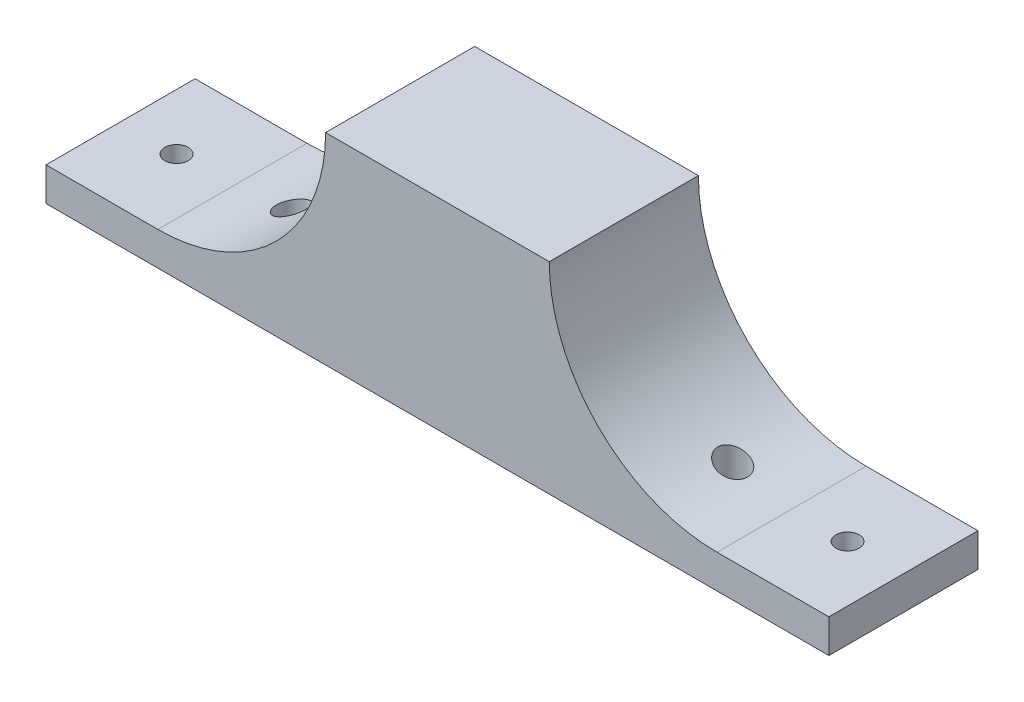
ISO-10303-21;
HEADER;
FILE_DESCRIPTION(('STEP AP214'),'2;1');
FILE_NAME('part.step','',(''),(''),'','','');
FILE_SCHEMA(('AUTOMOTIVE_DESIGN { 1 0 10303 214 1 1 1 1 }'));
ENDSEC;
DATA;
#1=APPLICATION_CONTEXT('core data for automotive mechanical design processes');
#2=APPLICATION_PROTOCOL_DEFINITION('international standard','automotive_design',2000,#1);
#3=PRODUCT_CONTEXT('',#1,'mechanical');
#4=PRODUCT('Part','Part','',(#3));
#5=PRODUCT_RELATED_PRODUCT_CATEGORY('part','',(#4));
#6=PRODUCT_DEFINITION_FORMATION('','',#4);
#7=PRODUCT_DEFINITION_CONTEXT('part definition',#1,'design');
#8=PRODUCT_DEFINITION('design','',#6,#7);
#9=PRODUCT_DEFINITION_SHAPE('','',#8);
#10=(LENGTH_UNIT() NAMED_UNIT(*) SI_UNIT(.MILLI.,.METRE.));
#11=(NAMED_UNIT(*) PLANE_ANGLE_UNIT() SI_UNIT($,.RADIAN.));
#12=(NAMED_UNIT(*) SI_UNIT($,.STERADIAN.) SOLID_ANGLE_UNIT());
#13=UNCERTAINTY_MEASURE_WITH_UNIT(LENGTH_MEASURE(1.E-05),#10,'distance_accuracy_value','');
#14=(GEOMETRIC_REPRESENTATION_CONTEXT(3) GLOBAL_UNCERTAINTY_ASSIGNED_CONTEXT((#13)) GLOBAL_UNIT_ASSIGNED_CONTEXT((#10,
#11,#12)) REPRESENTATION_CONTEXT('',''));
#15=CARTESIAN_POINT('',(0.,0.,0.));
#16=DIRECTION('',(0.,0.,1.));
#17=DIRECTION('',(1.,0.,0.));
#18=AXIS2_PLACEMENT_3D('',#15,#16,#17);
#19=CARTESIAN_POINT('',(-60.,54.,40.));
#20=DIRECTION('',(0.,0.,-1.));
#21=DIRECTION('',(-1.,0.,0.));
#22=AXIS2_PLACEMENT_3D('',#19,#20,#21);
#23=PLANE('',#22);
#24=CARTESIAN_POINT('',(-105.,54.,40.));
#25=DIRECTION('',(0.,0.,-1.));
#26=DIRECTION('',(-1.,0.,0.));
#27=AXIS2_PLACEMENT_3D('',#24,#25,#26);
#28=CIRCLE('',#27,45.0000000000001);
#29=CARTESIAN_POINT('',(-59.9999999999999,54.,40.));
#30=VERTEX_POINT('',#29);
#31=CARTESIAN_POINT('',(-105.,9.,40.));
#32=VERTEX_POINT('',#31);
#33=EDGE_CURVE('E120',#30,#32,#28,.T.);
#34=ORIENTED_EDGE('',*,*,#33,.T.);
#35=DIRECTION('',(-1.,0.,0.));
#36=VECTOR('',#35,1.);
#37=CARTESIAN_POINT('',(-60.,9.,40.));
#38=LINE('',#37,#36);
#39=CARTESIAN_POINT('',(-135.,9.,40.));
#40=VERTEX_POINT('',#39);
#41=EDGE_CURVE('E110',#32,#40,#38,.T.);
#42=ORIENTED_EDGE('',*,*,#41,.T.);
#43=DIRECTION('',(0.,-1.,0.));
#44=VECTOR('',#43,1.);
#45=CARTESIAN_POINT('',(-135.,54.,40.));
#46=LINE('',#45,#44);
#47=CARTESIAN_POINT('',(-135.,0.,40.));
#48=VERTEX_POINT('',#47);
#49=EDGE_CURVE('E117',#40,#48,#46,.T.);
#50=ORIENTED_EDGE('',*,*,#49,.T.);
#51=DIRECTION('',(1.,0.,0.));
#52=VECTOR('',#51,1.);
#53=CARTESIAN_POINT('',(-60.,0.,40.));
#54=LINE('',#53,#52);
#55=CARTESIAN_POINT('',(75.,0.,40.));
#56=VERTEX_POINT('',#55);
#57=EDGE_CURVE('E182',#48,#56,#54,.T.);
#58=ORIENTED_EDGE('',*,*,#57,.T.);
#59=DIRECTION('',(0.,-1.,0.));
#60=VECTOR('',#59,1.);
#61=CARTESIAN_POINT('',(75.,54.,40.));
#62=LINE('',#61,#60);
#63=CARTESIAN_POINT('',(75.,8.99999999999994,40.));
#64=VERTEX_POINT('',#63);
#65=EDGE_CURVE('E179',#64,#56,#62,.T.);
#66=ORIENTED_EDGE('',*,*,#65,.F.);
#67=DIRECTION('',(1.,0.,0.));
#68=VECTOR('',#67,1.);
#69=CARTESIAN_POINT('',(0.,9.,40.));
#70=LINE('',#69,#68);
#71=CARTESIAN_POINT('',(45.,9.,40.));
#72=VERTEX_POINT('',#71);
#73=EDGE_CURVE('E67',#72,#64,#70,.T.);
#74=ORIENTED_EDGE('',*,*,#73,.F.);
#75=CARTESIAN_POINT('',(45.,54.,40.));
#76=DIRECTION('',(0.,0.,1.));
#77=DIRECTION('',(1.,0.,0.));
#78=AXIS2_PLACEMENT_3D('',#75,#76,#77);
#79=CIRCLE('',#78,45.0000000000001);
#80=CARTESIAN_POINT('',(0.,54.,40.));
#81=VERTEX_POINT('',#80);
#82=EDGE_CURVE('E146',#81,#72,#79,.T.);
#83=ORIENTED_EDGE('',*,*,#82,.F.);
#84=DIRECTION('',(1.,0.,0.));
#85=VECTOR('',#84,1.);
#86=CARTESIAN_POINT('',(-60.,54.,40.));
#87=LINE('',#86,#85);
#88=EDGE_CURVE('E183',#30,#81,#87,.T.);
#89=ORIENTED_EDGE('',*,*,#88,.F.);
#90=EDGE_LOOP('',(#34,#42,#50,#58,#66,#74,#83,#89));
#91=FACE_BOUND('',#90,.T.);
#92=ADVANCED_FACE('F45',(#91),#23,.F.);
#93=CARTESIAN_POINT('',(-60.,54.,0.));
#94=DIRECTION('',(0.,0.,1.));
#95=DIRECTION('',(1.,0.,0.));
#96=AXIS2_PLACEMENT_3D('',#93,#94,#95);
#97=PLANE('',#96);
#98=CARTESIAN_POINT('',(-105.,54.,0.));
#99=DIRECTION('',(0.,0.,1.));
#100=DIRECTION('',(1.,0.,0.));
#101=AXIS2_PLACEMENT_3D('',#98,#99,#100);
#102=CIRCLE('',#101,45.0000000000001);
#103=CARTESIAN_POINT('',(-59.9999999999999,54.,0.));
#104=VERTEX_POINT('',#103);
#105=CARTESIAN_POINT('',(-105.,9.,0.));
#106=VERTEX_POINT('',#105);
#107=EDGE_CURVE('E236',#104,#106,#102,.F.);
#108=ORIENTED_EDGE('',*,*,#107,.F.);
#109=DIRECTION('',(-1.,0.,0.));
#110=VECTOR('',#109,1.);
#111=CARTESIAN_POINT('',(-60.,54.,0.));
#112=LINE('',#111,#110);
#113=CARTESIAN_POINT('',(0.,54.,0.));
#114=VERTEX_POINT('',#113);
#115=EDGE_CURVE('E186',#114,#104,#112,.T.);
#116=ORIENTED_EDGE('',*,*,#115,.F.);
#117=CARTESIAN_POINT('',(45.,54.,0.));
#118=DIRECTION('',(0.,0.,1.));
#119=DIRECTION('',(1.,0.,0.));
#120=AXIS2_PLACEMENT_3D('',#117,#118,#119);
#121=CIRCLE('',#120,45.0000000000001);
#122=CARTESIAN_POINT('',(45.,9.,0.));
#123=VERTEX_POINT('',#122);
#124=EDGE_CURVE('E160',#114,#123,#121,.T.);
#125=ORIENTED_EDGE('',*,*,#124,.T.);
#126=DIRECTION('',(1.,0.,0.));
#127=VECTOR('',#126,1.);
#128=CARTESIAN_POINT('',(-60.,9.,0.));
#129=LINE('',#128,#127);
#130=CARTESIAN_POINT('',(75.,9.,0.));
#131=VERTEX_POINT('',#130);
#132=EDGE_CURVE('E164',#123,#131,#129,.T.);
#133=ORIENTED_EDGE('',*,*,#132,.T.);
#134=DIRECTION('',(0.,-1.,0.));
#135=VECTOR('',#134,1.);
#136=CARTESIAN_POINT('',(75.,54.,0.));
#137=LINE('',#136,#135);
#138=CARTESIAN_POINT('',(75.,0.,0.));
#139=VERTEX_POINT('',#138);
#140=EDGE_CURVE('E176',#131,#139,#137,.T.);
#141=ORIENTED_EDGE('',*,*,#140,.T.);
#142=DIRECTION('',(-1.,0.,0.));
#143=VECTOR('',#142,1.);
#144=CARTESIAN_POINT('',(-60.,0.,0.));
#145=LINE('',#144,#143);
#146=CARTESIAN_POINT('',(-135.,0.,0.));
#147=VERTEX_POINT('',#146);
#148=EDGE_CURVE('E187',#139,#147,#145,.T.);
#149=ORIENTED_EDGE('',*,*,#148,.T.);
#150=DIRECTION('',(0.,-1.,0.));
#151=VECTOR('',#150,1.);
#152=CARTESIAN_POINT('',(-135.,54.,0.));
#153=LINE('',#152,#151);
#154=CARTESIAN_POINT('',(-135.,9.,0.));
#155=VERTEX_POINT('',#154);
#156=EDGE_CURVE('E129',#155,#147,#153,.T.);
#157=ORIENTED_EDGE('',*,*,#156,.F.);
#158=DIRECTION('',(-1.,0.,0.));
#159=VECTOR('',#158,1.);
#160=CARTESIAN_POINT('',(-60.,9.,0.));
#161=LINE('',#160,#159);
#162=EDGE_CURVE('E60',#106,#155,#161,.T.);
#163=ORIENTED_EDGE('',*,*,#162,.F.);
#164=EDGE_LOOP('',(#108,#116,#125,#133,#141,#149,#157,#163));
#165=FACE_BOUND('',#164,.T.);
#166=ADVANCED_FACE('F251',(#165),#97,.F.);
#167=CARTESIAN_POINT('',(0.,54.,0.));
#168=DIRECTION('',(0.,1.,0.));
#169=DIRECTION('',(0.,0.,1.));
#170=AXIS2_PLACEMENT_3D('',#167,#168,#169);
#171=PLANE('',#170);
#172=ORIENTED_EDGE('',*,*,#115,.T.);
#173=DIRECTION('',(0.,0.,1.));
#174=VECTOR('',#173,1.);
#175=CARTESIAN_POINT('',(-59.9999999999999,54.,-20.));
#176=LINE('',#175,#174);
#177=EDGE_CURVE('E237',#104,#30,#176,.T.);
#178=ORIENTED_EDGE('',*,*,#177,.T.);
#179=ORIENTED_EDGE('',*,*,#88,.T.);
#180=DIRECTION('',(0.,0.,1.));
#181=VECTOR('',#180,1.);
#182=CARTESIAN_POINT('',(0.,54.,-20.));
#183=LINE('',#182,#181);
#184=EDGE_CURVE('E152',#114,#81,#183,.T.);
#185=ORIENTED_EDGE('',*,*,#184,.F.);
#186=EDGE_LOOP('',(#172,#178,#179,#185));
#187=FACE_BOUND('',#186,.T.);
#188=ADVANCED_FACE('F223',(#187),#171,.T.);
#189=CARTESIAN_POINT('',(-135.,54.,0.));
#190=DIRECTION('',(-1.,0.,0.));
#191=DIRECTION('',(0.,0.,1.));
#192=AXIS2_PLACEMENT_3D('',#189,#190,#191);
#193=PLANE('',#192);
#194=ORIENTED_EDGE('',*,*,#49,.F.);
#195=DIRECTION('',(0.,0.,-1.));
#196=VECTOR('',#195,1.);
#197=CARTESIAN_POINT('',(-135.,9.,0.));
#198=LINE('',#197,#196);
#199=EDGE_CURVE('E11',#40,#155,#198,.T.);
#200=ORIENTED_EDGE('',*,*,#199,.T.);
#201=ORIENTED_EDGE('',*,*,#156,.T.);
#202=DIRECTION('',(0.,0.,-1.));
#203=VECTOR('',#202,1.);
#204=CARTESIAN_POINT('',(-135.,0.,0.));
#205=LINE('',#204,#203);
#206=EDGE_CURVE('E127',#48,#147,#205,.T.);
#207=ORIENTED_EDGE('',*,*,#206,.F.);
#208=EDGE_LOOP('',(#194,#200,#201,#207));
#209=FACE_BOUND('',#208,.T.);
#210=ADVANCED_FACE('F125',(#209),#193,.T.);
#211=CARTESIAN_POINT('',(-89.2,54.,20.));
#212=DIRECTION('',(0.,-1.,0.));
#213=DIRECTION('',(0.,0.,-1.));
#214=AXIS2_PLACEMENT_3D('',#211,#212,#213);
#215=CYLINDRICAL_SURFACE('',#214,4.);
#216=CARTESIAN_POINT('',(-89.2,0.,20.));
#217=DIRECTION('',(0.,-1.,0.));
#218=DIRECTION('',(0.,0.,1.));
#219=AXIS2_PLACEMENT_3D('',#216,#217,#218);
#220=CIRCLE('',#219,4.);
#221=CARTESIAN_POINT('',(-89.2,0.,24.));
#222=VERTEX_POINT('',#221);
#223=EDGE_CURVE('E135',#222,#222,#220,.T.);
#224=ORIENTED_EDGE('',*,*,#223,.T.);
#225=EDGE_LOOP('',(#224));
#226=FACE_BOUND('',#225,.T.);
#227=CARTESIAN_POINT('',(-89.2,11.8649789367561,16.));
#228=CARTESIAN_POINT('',(-88.95888767463,11.9553959826994,16.0000087288458));
#229=CARTESIAN_POINT('',(-88.7183597254217,12.0479729484538,16.0218524624179));
#230=CARTESIAN_POINT('',(-88.24535008652,12.2346242532197,16.1081366818495));
#231=CARTESIAN_POINT('',(-88.0128821106772,12.3287007814807,16.1726463467782));
#232=CARTESIAN_POINT('',(-87.5626859063672,12.5150698508551,16.3425300767701));
#233=CARTESIAN_POINT('',(-87.3449541537189,12.6073628147103,16.4478943305729));
#234=CARTESIAN_POINT('',(-86.9303582110852,12.7866646808283,16.6974027598569));
#235=CARTESIAN_POINT('',(-86.7334875461492,12.8736752190702,16.841534852979));
#236=CARTESIAN_POINT('',(-86.4603266426623,12.9964589845791,17.083030527851));
#237=CARTESIAN_POINT('',(-86.3735457746211,13.0358256630838,17.1670086822941));
#238=CARTESIAN_POINT('',(-86.2073974625575,13.1117816351055,17.3431298973986));
#239=CARTESIAN_POINT('',(-86.1280264315486,13.1483722708373,17.4352689649498));
#240=CARTESIAN_POINT('',(-85.9774736159203,13.2182591020799,17.6271941643159));
#241=CARTESIAN_POINT('',(-85.9062929877245,13.2515548322818,17.7269813726854));
#242=CARTESIAN_POINT('',(-85.7729587641782,13.3142984373065,17.9334860491725));
#243=CARTESIAN_POINT('',(-85.7108000864518,13.3437484775937,18.0401995660403));
#244=CARTESIAN_POINT('',(-85.6007905131706,13.3961321349065,18.2510879546937));
#245=CARTESIAN_POINT('',(-85.5521958147632,13.4193973411755,18.3547928155528));
#246=CARTESIAN_POINT('',(-85.4638662196027,13.4618466236601,18.5666588047295));
#247=CARTESIAN_POINT('',(-85.4241266997599,13.481032829189,18.6748175726509));
#248=CARTESIAN_POINT('',(-85.3539961220493,13.5149897955165,18.8947527775553));
#249=CARTESIAN_POINT('',(-85.3236012662668,13.5297623500686,19.0065277243606));
#250=CARTESIAN_POINT('',(-85.2725536526372,13.5546211545506,19.232790035457));
#251=CARTESIAN_POINT('',(-85.2519000414691,13.564707814958,19.3472771612416));
#252=CARTESIAN_POINT('',(-85.2221302322655,13.5792613611208,19.5668461495298));
#253=CARTESIAN_POINT('',(-85.2120963434771,13.5841750019542,19.6717750680431));
#254=CARTESIAN_POINT('',(-85.2003443287398,13.5899309635652,19.8822473705671));
#255=CARTESIAN_POINT('',(-85.1986289222913,13.5907719529006,19.9877909442338));
#256=CARTESIAN_POINT('',(-85.2035420507281,13.5883647978705,20.1985712271242));
#257=CARTESIAN_POINT('',(-85.2101654922713,13.5851191496103,20.3038080843517));
#258=CARTESIAN_POINT('',(-85.2316698026895,13.5745963062815,20.513268735706));
#259=CARTESIAN_POINT('',(-85.2465537248681,13.5673176204916,20.6174921407298));
#260=CARTESIAN_POINT('',(-85.2836499589077,13.5492157159446,20.8199791879877));
#261=CARTESIAN_POINT('',(-85.3055457386809,13.5385457220248,20.9183145796667));
#262=CARTESIAN_POINT('',(-85.3565522162102,13.513758432531,21.1126634978576));
#263=CARTESIAN_POINT('',(-85.3856654291116,13.4996399352411,21.2086762021257));
#264=CARTESIAN_POINT('',(-85.48340591721,13.4524003192198,21.4922514888547));
#265=CARTESIAN_POINT('',(-85.5624672059707,13.4143787093498,21.6755295098441));
#266=CARTESIAN_POINT('',(-85.7492078803925,13.3254617588893,22.033341030605));
#267=CARTESIAN_POINT('',(-85.857924676684,13.2741038448859,22.207211163155));
#268=CARTESIAN_POINT('',(-86.0987346124139,13.1617850059526,22.5344510445961));
#269=CARTESIAN_POINT('',(-86.2308358531818,13.1008207538004,22.6878136564148));
#270=CARTESIAN_POINT('',(-86.5273823347879,12.965975548928,22.9841009371487));
#271=CARTESIAN_POINT('',(-86.693658177296,12.8914282923722,23.1248888298325));
#272=CARTESIAN_POINT('',(-87.0450166438911,12.7367543409368,23.3768069189619));
#273=CARTESIAN_POINT('',(-87.2301068793544,12.6566253921382,23.4879250460236));
#274=CARTESIAN_POINT('',(-87.6309913496275,12.4865228676343,23.6867875700715));
#275=CARTESIAN_POINT('',(-87.8480583296663,12.3962904715729,23.7717531497613));
#276=CARTESIAN_POINT('',(-88.2934958056429,12.2154271163226,23.9028427542801));
#277=CARTESIAN_POINT('',(-88.5218693038946,12.1247960571577,23.9489564032269));
#278=CARTESIAN_POINT('',(-88.9927457105874,11.942493736291,24.0019031105174));
#279=CARTESIAN_POINT('',(-89.235457689954,11.8509102045083,24.0072035977583));
#280=CARTESIAN_POINT('',(-89.7197503417083,11.6729340375271,23.9735071504354));
#281=CARTESIAN_POINT('',(-89.9613310790651,11.5865411007673,23.9345127919228));
#282=CARTESIAN_POINT('',(-90.4310470073589,11.4229373806364,23.8134194136945));
#283=CARTESIAN_POINT('',(-90.6593538354444,11.3455784747155,23.7321905912376));
#284=CARTESIAN_POINT('',(-91.0998728220919,11.1999967069166,23.528360097006));
#285=CARTESIAN_POINT('',(-91.312089854592,11.1317710735442,23.4057710159456));
#286=CARTESIAN_POINT('',(-91.7022302305401,11.0091980399637,23.1293807544878));
#287=CARTESIAN_POINT('',(-91.8813585182589,10.9543159401953,22.9775180439561));
#288=CARTESIAN_POINT('',(-92.2115985591652,10.8550515811898,22.6430014823106));
#289=CARTESIAN_POINT('',(-92.3627189059006,10.810666100166,22.4603571087426));
#290=CARTESIAN_POINT('',(-92.6243529593765,10.7349906450263,22.0795355382398));
#291=CARTESIAN_POINT('',(-92.7365344985877,10.7031516610251,21.8826120167731));
#292=CARTESIAN_POINT('',(-92.926387612791,10.6498250783243,21.4714843469385));
#293=CARTESIAN_POINT('',(-93.0040663191972,10.6283353404544,21.2572837803998));
#294=CARTESIAN_POINT('',(-93.1201023110102,10.5964108198175,20.8253284873733));
#295=CARTESIAN_POINT('',(-93.1596716245322,10.5856349039157,20.6079238023174));
#296=CARTESIAN_POINT('',(-93.2024829445264,10.5739812675542,20.1693114397272));
#297=CARTESIAN_POINT('',(-93.205728698219,10.5731025260796,19.9481041568355));
#298=CARTESIAN_POINT('',(-93.1759953018827,10.5811892358565,19.511441237489));
#299=CARTESIAN_POINT('',(-93.1435211473584,10.5900174528895,19.2959484164389));
#300=CARTESIAN_POINT('',(-93.044267530258,10.6172490262598,18.8736561309735));
#301=CARTESIAN_POINT('',(-92.9774886914196,10.6356522085025,18.6668565085699));
#302=CARTESIAN_POINT('',(-92.8116652592419,10.681968189987,18.2671356255283));
#303=CARTESIAN_POINT('',(-92.7125355189282,10.7099060934164,18.0742526472071));
#304=CARTESIAN_POINT('',(-92.4853669461872,10.7750318771411,17.7081032147542));
#305=CARTESIAN_POINT('',(-92.3573277240986,10.8122198821161,17.534837025078));
#306=CARTESIAN_POINT('',(-92.073789195494,10.896226513408,17.2091525997051));
#307=CARTESIAN_POINT('',(-91.9178161188499,10.9432140605038,17.0571909023536));
#308=CARTESIAN_POINT('',(-91.5850256192219,11.0457366259408,16.7815587202406));
#309=CARTESIAN_POINT('',(-91.4082002048847,11.1012749237399,16.6578991355891));
#310=CARTESIAN_POINT('',(-91.0321910248303,11.2221937907571,16.4373704597974));
#311=CARTESIAN_POINT('',(-90.8324231945781,11.2878618002285,16.3416575759173));
#312=CARTESIAN_POINT('',(-90.4221772659025,11.4261369713252,16.1849726160653));
#313=CARTESIAN_POINT('',(-90.2117088943649,11.4987378818091,16.1239695825338));
#314=CARTESIAN_POINT('',(-89.8667690448109,11.620700423393,16.0536593460537));
#315=CARTESIAN_POINT('',(-89.733814572306,11.6684078145216,16.0335162994002));
#316=CARTESIAN_POINT('',(-89.4671803458392,11.7655157365371,16.0066842595662));
#317=CARTESIAN_POINT('',(-89.3335005972445,11.8149162549086,15.9999951669574));
#318=CARTESIAN_POINT('',(-89.2,11.8649789367561,16.));
#319=B_SPLINE_CURVE_WITH_KNOTS('',3,(#227,#228,#229,#230,#231,#232,#233,#234,#235,#236,#237,
#238,#239,#240,#241,#242,#243,#244,#245,#246,#247,#248,#249,#250,#251,#252,#253,#254,#255,#256,
#257,#258,#259,#260,#261,#262,#263,#264,#265,#266,#267,#268,#269,#270,#271,#272,#273,#274,#275,
#276,#277,#278,#279,#280,#281,#282,#283,#284,#285,#286,#287,#288,#289,#290,#291,#292,#293,#294,
#295,#296,#297,#298,#299,#300,#301,#302,#303,#304,#305,#306,#307,#308,#309,#310,#311,#312,#313,
#314,#315,#316,#317,#318),.UNSPECIFIED.,.T.,.F.,(4,2,2,2,2,2,2,2,2,2,2,2,2,2,2,2,2,2,2,2,2,2,2,
2,2,2,2,2,2,2,2,2,2,2,2,2,2,2,2,2,2,2,2,2,2,4),(0.,0.772001939283186,1.54525869083289,
2.31832985908391,3.09116037109719,3.47179240194681,3.85223920882661,4.23273966620944,
4.61302493562653,4.96314674827098,5.31308533967434,5.66288151833431,6.01264704958138,
6.32881463380183,6.64508557340522,6.96116342940639,7.27735819446981,7.58092067638415,
7.88458909341913,8.49138623966434,9.12297906566424,9.7547911310556,10.4427174184642,
11.1309231229998,11.8774506865631,12.6241775562811,13.3988140995764,14.1734055947136,
14.9326352383834,15.6916339688118,16.4114419833375,17.1310287755153,17.8142027994099,
18.4972355518197,19.1577479306293,19.8181921688594,20.4694179144393,21.1206318196651,
21.7735737207617,22.4265244231723,23.0918306583915,23.7573926961944,24.4475002950735,
25.1369914213694,25.5644414966775,25.9918884130058),.UNSPECIFIED.);
#320=CARTESIAN_POINT('',(-89.2,11.8649789367561,16.));
#321=VERTEX_POINT('',#320);
#322=EDGE_CURVE('E230',#321,#321,#319,.T.);
#323=ORIENTED_EDGE('',*,*,#322,.F.);
#324=EDGE_LOOP('',(#323));
#325=FACE_BOUND('',#324,.T.);
#326=ADVANCED_FACE('F222',(#226,#325),#215,.F.);
#327=CARTESIAN_POINT('',(0.,0.,0.));
#328=DIRECTION('',(0.,1.,0.));
#329=DIRECTION('',(0.,0.,1.));
#330=AXIS2_PLACEMENT_3D('',#327,#328,#329);
#331=PLANE('',#330);
#332=CARTESIAN_POINT('',(-120.,0.,20.));
#333=DIRECTION('',(0.,1.,0.));
#334=DIRECTION('',(0.,0.,1.));
#335=AXIS2_PLACEMENT_3D('',#332,#333,#334);
#336=CIRCLE('',#335,3.12499999999998);
#337=CARTESIAN_POINT('',(-120.,0.,23.125));
#338=VERTEX_POINT('',#337);
#339=EDGE_CURVE('E122',#338,#338,#336,.T.);
#340=ORIENTED_EDGE('',*,*,#339,.T.);
#341=EDGE_LOOP('',(#340));
#342=FACE_BOUND('',#341,.T.);
#343=CARTESIAN_POINT('',(60.,0.,20.));
#344=DIRECTION('',(0.,1.,0.));
#345=DIRECTION('',(0.,0.,1.));
#346=AXIS2_PLACEMENT_3D('',#343,#344,#345);
#347=CIRCLE('',#346,3.12499999999998);
#348=CARTESIAN_POINT('',(60.,0.,23.125));
#349=VERTEX_POINT('',#348);
#350=EDGE_CURVE('E142',#349,#349,#347,.T.);
#351=ORIENTED_EDGE('',*,*,#350,.T.);
#352=EDGE_LOOP('',(#351));
#353=FACE_BOUND('',#352,.T.);
#354=ORIENTED_EDGE('',*,*,#57,.F.);
#355=ORIENTED_EDGE('',*,*,#206,.T.);
#356=ORIENTED_EDGE('',*,*,#148,.F.);
#357=DIRECTION('',(0.,0.,-1.));
#358=VECTOR('',#357,1.);
#359=CARTESIAN_POINT('',(75.,0.,0.));
#360=LINE('',#359,#358);
#361=EDGE_CURVE('E172',#56,#139,#360,.T.);
#362=ORIENTED_EDGE('',*,*,#361,.F.);
#363=EDGE_LOOP('',(#354,#355,#356,#362));
#364=FACE_BOUND('',#363,.T.);
#365=CARTESIAN_POINT('',(29.2,0.,20.));
#366=DIRECTION('',(0.,1.,0.));
#367=DIRECTION('',(0.,0.,1.));
#368=AXIS2_PLACEMENT_3D('',#365,#366,#367);
#369=CIRCLE('',#368,4.);
#370=CARTESIAN_POINT('',(29.2,0.,24.));
#371=VERTEX_POINT('',#370);
#372=EDGE_CURVE('E168',#371,#371,#369,.T.);
#373=ORIENTED_EDGE('',*,*,#372,.T.);
#374=EDGE_LOOP('',(#373));
#375=FACE_BOUND('',#374,.T.);
#376=ORIENTED_EDGE('',*,*,#223,.F.);
#377=EDGE_LOOP('',(#376));
#378=FACE_BOUND('',#377,.T.);
#379=ADVANCED_FACE('F227',(#342,#353,#364,#375,#378),#331,.F.);
#380=CARTESIAN_POINT('',(75.,54.,0.));
#381=DIRECTION('',(-1.,0.,0.));
#382=DIRECTION('',(0.,0.,1.));
#383=AXIS2_PLACEMENT_3D('',#380,#381,#382);
#384=PLANE('',#383);
#385=ORIENTED_EDGE('',*,*,#140,.F.);
#386=DIRECTION('',(0.,0.,1.));
#387=VECTOR('',#386,1.);
#388=CARTESIAN_POINT('',(75.,9.,0.));
#389=LINE('',#388,#387);
#390=EDGE_CURVE('E53',#131,#64,#389,.T.);
#391=ORIENTED_EDGE('',*,*,#390,.T.);
#392=ORIENTED_EDGE('',*,*,#65,.T.);
#393=ORIENTED_EDGE('',*,*,#361,.T.);
#394=EDGE_LOOP('',(#385,#391,#392,#393));
#395=FACE_BOUND('',#394,.T.);
#396=ADVANCED_FACE('F264',(#395),#384,.F.);
#397=CARTESIAN_POINT('',(29.2,54.,20.));
#398=DIRECTION('',(0.,-1.,0.));
#399=DIRECTION('',(0.,0.,-1.));
#400=AXIS2_PLACEMENT_3D('',#397,#398,#399);
#401=CYLINDRICAL_SURFACE('',#400,4.);
#402=CARTESIAN_POINT('',(29.2,11.8649789367561,16.));
#403=CARTESIAN_POINT('',(29.4308236212375,11.7784261988053,16.0000077923523));
#404=CARTESIAN_POINT('',(29.6625000864389,11.6937331085099,16.0200224860265));
#405=CARTESIAN_POINT('',(30.121077229106,11.5302809029071,16.1005286824003));
#406=CARTESIAN_POINT('',(30.3479737608528,11.451526797289,16.1610539411216));
#407=CARTESIAN_POINT('',(30.7903734590848,11.3017430662272,16.3222011132498));
#408=CARTESIAN_POINT('',(31.0058551358892,11.2307277616344,16.4228958092115));
#409=CARTESIAN_POINT('',(31.4176188498204,11.0981848578067,16.6625067972823));
#410=CARTESIAN_POINT('',(31.6139080090749,11.0366537341756,16.8014088375504));
#411=CARTESIAN_POINT('',(31.9723370861957,10.9266470658305,17.107370863005));
#412=CARTESIAN_POINT('',(32.135571313135,10.8777289131544,17.2729889214845));
#413=CARTESIAN_POINT('',(32.4319091648689,10.7904290420127,17.6317010219255));
#414=CARTESIAN_POINT('',(32.565020061389,10.7520447802052,17.8247884144632));
#415=CARTESIAN_POINT('',(32.7906514912152,10.6878194728089,18.223155143166));
#416=CARTESIAN_POINT('',(32.8847741132739,10.661477382824,18.4274474235818));
#417=CARTESIAN_POINT('',(33.0376547288441,10.6190290345726,18.8498582628897));
#418=CARTESIAN_POINT('',(33.0964191756558,10.6029209084522,19.0679742907413));
#419=CARTESIAN_POINT('',(33.1753263875511,10.5813550426179,19.5052599433084));
#420=CARTESIAN_POINT('',(33.1965034118573,10.5756120178893,19.7242294684047));
#421=CARTESIAN_POINT('',(33.2026976167543,10.5739286395452,20.1627090186173));
#422=CARTESIAN_POINT('',(33.187717780758,10.5779874771482,20.3822189976462));
#423=CARTESIAN_POINT('',(33.1224423749701,10.5957982279705,20.8133438777178));
#424=CARTESIAN_POINT('',(33.0724870443502,10.6094567609189,21.0250143236411));
#425=CARTESIAN_POINT('',(32.9393314143676,10.6462803369835,21.4367370349489));
#426=CARTESIAN_POINT('',(32.8561312045239,10.6694453545014,21.6367893316162));
#427=CARTESIAN_POINT('',(32.6586103139691,10.7252885419461,22.021141121116));
#428=CARTESIAN_POINT('',(32.5440857090342,10.7580291500133,22.2053266106166));
#429=CARTESIAN_POINT('',(32.2879441363958,10.8326352527863,22.5516674055363));
#430=CARTESIAN_POINT('',(32.14632508841,10.8745014481792,22.7138210177358));
#431=CARTESIAN_POINT('',(31.8368876800476,10.9679289882572,23.0157304420353));
#432=CARTESIAN_POINT('',(31.6685345265151,11.0196939883114,23.1548744683396));
#433=CARTESIAN_POINT('',(31.3133903659698,11.1314643334216,23.403018812966));
#434=CARTESIAN_POINT('',(31.1265962890939,11.19147105113,23.5120141009028));
#435=CARTESIAN_POINT('',(30.7321187308913,11.321289300011,23.7016788290421));
#436=CARTESIAN_POINT('',(30.5238950392791,11.3913999976863,23.7810185480936));
#437=CARTESIAN_POINT('',(30.0993066995582,11.5380191653416,23.9038610246392));
#438=CARTESIAN_POINT('',(29.8829400598602,11.6145292061298,23.9473549546788));
#439=CARTESIAN_POINT('',(29.4363716987553,11.7763961712731,23.999656742918));
#440=CARTESIAN_POINT('',(29.2060362279951,11.8620063135246,24.0065405199509));
#441=CARTESIAN_POINT('',(28.7486997809749,12.036263289394,23.9810586188588));
#442=CARTESIAN_POINT('',(28.5216997476787,12.1249109590186,23.9486820495644));
#443=CARTESIAN_POINT('',(28.0667506236929,12.3067429880962,23.8435185104492));
#444=CARTESIAN_POINT('',(27.8392115675557,12.3999532056667,23.7689920394546));
#445=CARTESIAN_POINT('',(27.4001263034984,12.5838052003296,23.5801721941228));
#446=CARTESIAN_POINT('',(27.1885833306606,12.6744464555644,23.4658708016651));
#447=CARTESIAN_POINT('',(26.7864143241271,12.8501074595918,23.1989138649731));
#448=CARTESIAN_POINT('',(26.5959068117228,12.9350943794702,23.0460554996119));
#449=CARTESIAN_POINT('',(26.3319400528519,13.0547563542879,22.7909276890656));
#450=CARTESIAN_POINT('',(26.2475455425474,13.093358554472,22.7015254291494));
#451=CARTESIAN_POINT('',(26.0868016916799,13.1674305259157,22.5145896533473));
#452=CARTESIAN_POINT('',(26.0104480959754,13.2029019523124,22.4170604875553));
#453=CARTESIAN_POINT('',(25.8707727475971,13.268215464447,22.2203492429513));
#454=CARTESIAN_POINT('',(25.8069526598073,13.2982644870428,22.1215890849644));
#455=CARTESIAN_POINT('',(25.6878931213775,13.3546206373309,21.9180699628645));
#456=CARTESIAN_POINT('',(25.6326493205403,13.3809296615084,21.8133140771487));
#457=CARTESIAN_POINT('',(25.5313898996758,13.4293656303746,21.5985580773296));
#458=CARTESIAN_POINT('',(25.4853703789735,13.4514943425645,21.4885602043674));
#459=CARTESIAN_POINT('',(25.4031366856103,13.4911733526736,21.2641609733386));
#460=CARTESIAN_POINT('',(25.3669214684508,13.5087241382936,21.1497600858302));
#461=CARTESIAN_POINT('',(25.307871911926,13.5374116167135,20.9290190032621));
#462=CARTESIAN_POINT('',(25.2840701187967,13.5490101972216,20.8229966481395));
#463=CARTESIAN_POINT('',(25.2451374536245,13.5680092373637,20.6090042465711));
#464=CARTESIAN_POINT('',(25.2300058189842,13.575410066217,20.5010343722843));
#465=CARTESIAN_POINT('',(25.2086099155746,13.5858809200832,20.2840519794337));
#466=CARTESIAN_POINT('',(25.2023422795304,13.588952589665,20.175039872648));
#467=CARTESIAN_POINT('',(25.1987447418117,13.5907152474996,19.9568356740724));
#468=CARTESIAN_POINT('',(25.2014145263587,13.5894063895457,19.8476435887358));
#469=CARTESIAN_POINT('',(25.2151770751916,13.5826666308238,19.637336868905));
#470=CARTESIAN_POINT('',(25.2256886352245,13.5775201707127,19.5361748841626));
#471=CARTESIAN_POINT('',(25.2543257295154,13.5635240149583,19.335185426274));
#472=CARTESIAN_POINT('',(25.2724537133147,13.5546731279264,19.235358393133));
#473=CARTESIAN_POINT('',(25.3379926477083,13.5227481990562,18.9389995103356));
#474=CARTESIAN_POINT('',(25.3965728605634,13.494294765133,18.745378347192));
#475=CARTESIAN_POINT('',(25.541987876585,13.4242402642701,18.3689792528501));
#476=CARTESIAN_POINT('',(25.6291586386638,13.3824830442203,18.1863624114001));
#477=CARTESIAN_POINT('',(25.8284150264132,13.2880550601102,17.8383745045811));
#478=CARTESIAN_POINT('',(25.9405067074806,13.2353816437947,17.6730076450625));
#479=CARTESIAN_POINT('',(26.1956085865252,13.1170443931669,17.350650515658));
#480=CARTESIAN_POINT('',(26.3403271047064,13.0506953929886,17.1952664824313));
#481=CARTESIAN_POINT('',(26.6505061342455,12.9107674695641,16.9105910862511));
#482=CARTESIAN_POINT('',(26.8159794406967,12.8371840925073,16.7813159485785));
#483=CARTESIAN_POINT('',(27.1796940732214,12.6783399479495,16.5401900395811));
#484=CARTESIAN_POINT('',(27.3795513506613,12.5926293122807,16.431071747302));
#485=CARTESIAN_POINT('',(27.7937895841391,12.4187942540205,16.2484998961666));
#486=CARTESIAN_POINT('',(28.0081606656501,12.3306714963647,16.17502236139));
#487=CARTESIAN_POINT('',(28.385754289508,12.1789985319322,16.0803357460542));
#488=CARTESIAN_POINT('',(28.5467896894828,12.1153699009367,16.0503023082726));
#489=CARTESIAN_POINT('',(28.8717392086139,11.9891728869037,16.0101313007573));
#490=CARTESIAN_POINT('',(29.0356534318476,11.9266045423599,15.9999944518401));
#491=CARTESIAN_POINT('',(29.2,11.8649789367561,16.));
#492=B_SPLINE_CURVE_WITH_KNOTS('',3,(#402,#403,#404,#405,#406,#407,#408,#409,#410,#411,#412,
#413,#414,#415,#416,#417,#418,#419,#420,#421,#422,#423,#424,#425,#426,#427,#428,#429,#430,#431,
#432,#433,#434,#435,#436,#437,#438,#439,#440,#441,#442,#443,#444,#445,#446,#447,#448,#449,#450,
#451,#452,#453,#454,#455,#456,#457,#458,#459,#460,#461,#462,#463,#464,#465,#466,#467,#468,#469,
#470,#471,#472,#473,#474,#475,#476,#477,#478,#479,#480,#481,#482,#483,#484,#485,#486,#487,#488,
#489,#490,#491),.UNSPECIFIED.,.T.,.F.,(4,2,2,2,2,2,2,2,2,2,2,2,2,2,2,2,2,2,2,2,2,2,2,2,2,2,2,2,
2,2,2,2,2,2,2,2,2,2,2,2,2,2,2,2,4),(0.,0.738950576942364,1.47851766311752,2.21943089357363,
2.96006812757592,3.6693335532689,4.37842758030545,5.05448697987127,5.73042295285361,
6.38745331346759,7.04442946235255,7.69510182171358,8.34577242901083,9.00078414035984,
9.65584616300259,10.3262123499266,10.9966903215883,11.6943902085717,12.3922618612032,
13.126472633434,13.8608871288676,14.6280878182112,15.3954432551776,16.1669226033996,
16.5530619901428,16.9389959994216,17.3026065154943,17.6660319885062,18.0293034539125,
18.3925362030558,18.7199435995648,19.0473221940136,19.3745763897375,19.7018190962105,
20.006954704825,20.312188524242,20.9220277437282,21.5393063649077,22.1567351394616,
22.8213542883992,23.4863852002115,24.2131663161841,24.9394578382916,25.465572068942,
25.9917053593898),.UNSPECIFIED.);
#493=CARTESIAN_POINT('',(29.2,11.8649789367561,16.));
#494=VERTEX_POINT('',#493);
#495=EDGE_CURVE('E156',#494,#494,#492,.T.);
#496=ORIENTED_EDGE('',*,*,#495,.F.);
#497=EDGE_LOOP('',(#496));
#498=FACE_BOUND('',#497,.T.);
#499=ORIENTED_EDGE('',*,*,#372,.F.);
#500=EDGE_LOOP('',(#499));
#501=FACE_BOUND('',#500,.T.);
#502=ADVANCED_FACE('F204',(#498,#501),#401,.F.);
#503=CARTESIAN_POINT('',(0.,9.,-20.));
#504=DIRECTION('',(0.,-1.,0.));
#505=DIRECTION('',(0.,0.,-1.));
#506=AXIS2_PLACEMENT_3D('',#503,#504,#505);
#507=PLANE('',#506);
#508=CARTESIAN_POINT('',(60.,9.,20.));
#509=DIRECTION('',(0.,1.,0.));
#510=DIRECTION('',(0.,0.,1.));
#511=AXIS2_PLACEMENT_3D('',#508,#509,#510);
#512=CIRCLE('',#511,3.12499999999999);
#513=CARTESIAN_POINT('',(60.,9.,23.125));
#514=VERTEX_POINT('',#513);
#515=EDGE_CURVE('E133',#514,#514,#512,.T.);
#516=ORIENTED_EDGE('',*,*,#515,.F.);
#517=EDGE_LOOP('',(#516));
#518=FACE_BOUND('',#517,.T.);
#519=DIRECTION('',(0.,0.,1.));
#520=VECTOR('',#519,1.);
#521=CARTESIAN_POINT('',(45.,9.,-20.));
#522=LINE('',#521,#520);
#523=EDGE_CURVE('E153',#123,#72,#522,.T.);
#524=ORIENTED_EDGE('',*,*,#523,.T.);
#525=ORIENTED_EDGE('',*,*,#73,.T.);
#526=ORIENTED_EDGE('',*,*,#390,.F.);
#527=ORIENTED_EDGE('',*,*,#132,.F.);
#528=EDGE_LOOP('',(#524,#525,#526,#527));
#529=FACE_BOUND('',#528,.T.);
#530=ADVANCED_FACE('F212',(#518,#529),#507,.F.);
#531=CARTESIAN_POINT('',(45.,54.,-20.));
#532=DIRECTION('',(0.,0.,1.));
#533=DIRECTION('',(1.,0.,0.));
#534=AXIS2_PLACEMENT_3D('',#531,#532,#533);
#535=CYLINDRICAL_SURFACE('',#534,45.0000000000001);
#536=ORIENTED_EDGE('',*,*,#495,.T.);
#537=EDGE_LOOP('',(#536));
#538=FACE_BOUND('',#537,.T.);
#539=ORIENTED_EDGE('',*,*,#184,.T.);
#540=ORIENTED_EDGE('',*,*,#82,.T.);
#541=ORIENTED_EDGE('',*,*,#523,.F.);
#542=ORIENTED_EDGE('',*,*,#124,.F.);
#543=EDGE_LOOP('',(#539,#540,#541,#542));
#544=FACE_BOUND('',#543,.T.);
#545=ADVANCED_FACE('F207',(#538,#544),#535,.F.);
#546=CARTESIAN_POINT('',(60.,9.,20.));
#547=DIRECTION('',(0.,1.,0.));
#548=DIRECTION('',(0.,0.,1.));
#549=AXIS2_PLACEMENT_3D('',#546,#547,#548);
#550=CYLINDRICAL_SURFACE('',#549,3.12499999999998);
#551=ORIENTED_EDGE('',*,*,#350,.F.);
#552=EDGE_LOOP('',(#551));
#553=FACE_BOUND('',#552,.T.);
#554=ORIENTED_EDGE('',*,*,#515,.T.);
#555=EDGE_LOOP('',(#554));
#556=FACE_BOUND('',#555,.T.);
#557=ADVANCED_FACE('F211',(#553,#556),#550,.F.);
#558=CARTESIAN_POINT('',(-60.,9.,-20.));
#559=DIRECTION('',(0.,1.,0.));
#560=DIRECTION('',(0.,0.,1.));
#561=AXIS2_PLACEMENT_3D('',#558,#559,#560);
#562=PLANE('',#561);
#563=CARTESIAN_POINT('',(-120.,9.,20.));
#564=DIRECTION('',(0.,1.,0.));
#565=DIRECTION('',(0.,0.,1.));
#566=AXIS2_PLACEMENT_3D('',#563,#564,#565);
#567=CIRCLE('',#566,3.12499999999999);
#568=CARTESIAN_POINT('',(-120.,9.,23.125));
#569=VERTEX_POINT('',#568);
#570=EDGE_CURVE('E306',#569,#569,#567,.T.);
#571=ORIENTED_EDGE('',*,*,#570,.F.);
#572=EDGE_LOOP('',(#571));
#573=FACE_BOUND('',#572,.T.);
#574=ORIENTED_EDGE('',*,*,#162,.T.);
#575=ORIENTED_EDGE('',*,*,#199,.F.);
#576=ORIENTED_EDGE('',*,*,#41,.F.);
#577=DIRECTION('',(0.,0.,1.));
#578=VECTOR('',#577,1.);
#579=CARTESIAN_POINT('',(-105.,9.,-20.));
#580=LINE('',#579,#578);
#581=EDGE_CURVE('E290',#106,#32,#580,.T.);
#582=ORIENTED_EDGE('',*,*,#581,.F.);
#583=EDGE_LOOP('',(#574,#575,#576,#582));
#584=FACE_BOUND('',#583,.T.);
#585=ADVANCED_FACE('F109',(#573,#584),#562,.T.);
#586=CARTESIAN_POINT('',(-105.,54.,-20.));
#587=DIRECTION('',(0.,0.,1.));
#588=DIRECTION('',(1.,0.,0.));
#589=AXIS2_PLACEMENT_3D('',#586,#587,#588);
#590=CYLINDRICAL_SURFACE('',#589,45.0000000000001);
#591=ORIENTED_EDGE('',*,*,#322,.T.);
#592=EDGE_LOOP('',(#591));
#593=FACE_BOUND('',#592,.T.);
#594=ORIENTED_EDGE('',*,*,#107,.T.);
#595=ORIENTED_EDGE('',*,*,#581,.T.);
#596=ORIENTED_EDGE('',*,*,#33,.F.);
#597=ORIENTED_EDGE('',*,*,#177,.F.);
#598=EDGE_LOOP('',(#594,#595,#596,#597));
#599=FACE_BOUND('',#598,.T.);
#600=ADVANCED_FACE('F238',(#593,#599),#590,.F.);
#601=CARTESIAN_POINT('',(-120.,9.,20.));
#602=DIRECTION('',(0.,1.,0.));
#603=DIRECTION('',(0.,0.,1.));
#604=AXIS2_PLACEMENT_3D('',#601,#602,#603);
#605=CYLINDRICAL_SURFACE('',#604,3.12499999999998);
#606=ORIENTED_EDGE('',*,*,#339,.F.);
#607=EDGE_LOOP('',(#606));
#608=FACE_BOUND('',#607,.T.);
#609=ORIENTED_EDGE('',*,*,#570,.T.);
#610=EDGE_LOOP('',(#609));
#611=FACE_BOUND('',#610,.T.);
#612=ADVANCED_FACE('F242',(#608,#611),#605,.F.);
#613=CLOSED_SHELL('',(#92,#166,#188,#210,#326,#379,#396,#502,#530,#545,#557,#585,#600,#612));
#614=MANIFOLD_SOLID_BREP('B2',#613);
#615=ADVANCED_BREP_SHAPE_REPRESENTATION('',(#18,#614),#14);
#616=SHAPE_DEFINITION_REPRESENTATION(#9,#615);
ENDSEC;
END-ISO-10303-21;
